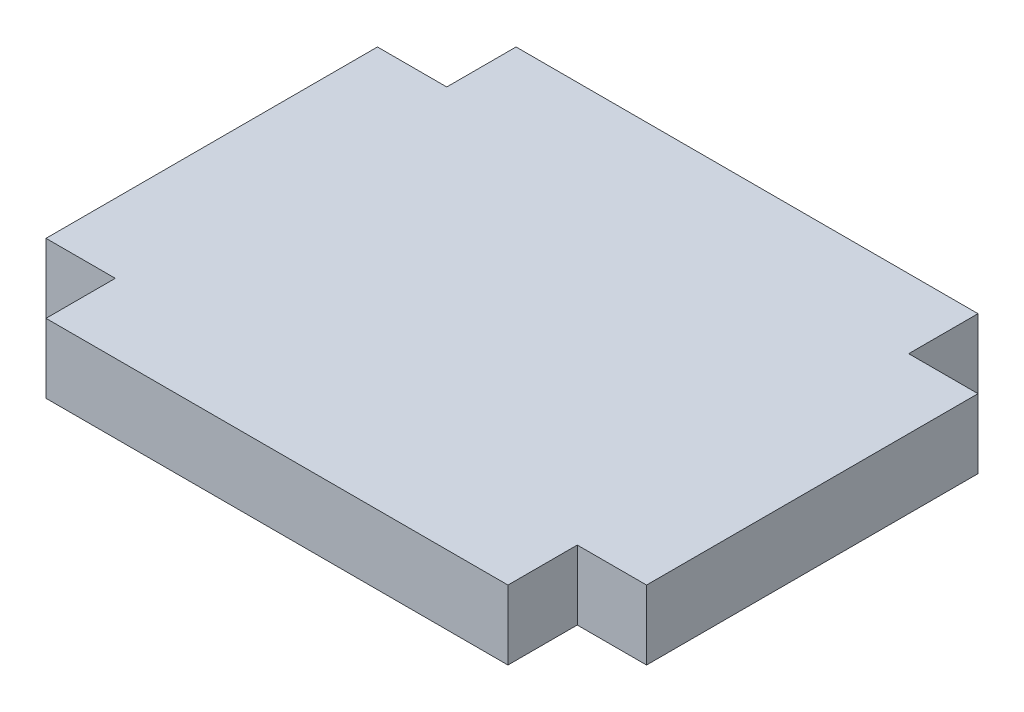
ISO-10303-21;
HEADER;
FILE_DESCRIPTION(('STEP AP214'),'2;1');
FILE_NAME('part.step','',(''),(''),'','','');
FILE_SCHEMA(('AUTOMOTIVE_DESIGN { 1 0 10303 214 1 1 1 1 }'));
ENDSEC;
DATA;
#1=APPLICATION_CONTEXT('core data for automotive mechanical design processes');
#2=APPLICATION_PROTOCOL_DEFINITION('international standard','automotive_design',2000,#1);
#3=PRODUCT_CONTEXT('',#1,'mechanical');
#4=PRODUCT('Part','Part','',(#3));
#5=PRODUCT_RELATED_PRODUCT_CATEGORY('part','',(#4));
#6=PRODUCT_DEFINITION_FORMATION('','',#4);
#7=PRODUCT_DEFINITION_CONTEXT('part definition',#1,'design');
#8=PRODUCT_DEFINITION('design','',#6,#7);
#9=PRODUCT_DEFINITION_SHAPE('','',#8);
#10=(LENGTH_UNIT() NAMED_UNIT(*) SI_UNIT(.MILLI.,.METRE.));
#11=(NAMED_UNIT(*) PLANE_ANGLE_UNIT() SI_UNIT($,.RADIAN.));
#12=(NAMED_UNIT(*) SI_UNIT($,.STERADIAN.) SOLID_ANGLE_UNIT());
#13=UNCERTAINTY_MEASURE_WITH_UNIT(LENGTH_MEASURE(1.E-05),#10,'distance_accuracy_value','');
#14=(GEOMETRIC_REPRESENTATION_CONTEXT(3) GLOBAL_UNCERTAINTY_ASSIGNED_CONTEXT((#13)) GLOBAL_UNIT_ASSIGNED_CONTEXT((#10,
#11,#12)) REPRESENTATION_CONTEXT('',''));
#15=CARTESIAN_POINT('',(0.,0.,0.));
#16=DIRECTION('',(0.,0.,1.));
#17=DIRECTION('',(1.,0.,0.));
#18=AXIS2_PLACEMENT_3D('',#15,#16,#17);
#19=CARTESIAN_POINT('',(-10.,1.5,-7.175));
#20=DIRECTION('',(1.,0.,0.));
#21=DIRECTION('',(0.,0.,-1.));
#22=AXIS2_PLACEMENT_3D('',#19,#20,#21);
#23=PLANE('',#22);
#24=DIRECTION('',(0.,0.,1.));
#25=VECTOR('',#24,1.);
#26=CARTESIAN_POINT('',(-10.,-1.5,-7.175));
#27=LINE('',#26,#25);
#28=CARTESIAN_POINT('',(-10.,-1.5,-10.175));
#29=VERTEX_POINT('',#28);
#30=CARTESIAN_POINT('',(-10.,-1.5,-7.175));
#31=VERTEX_POINT('',#30);
#32=EDGE_CURVE('E159',#29,#31,#27,.T.);
#33=ORIENTED_EDGE('',*,*,#32,.T.);
#34=DIRECTION('',(0.,-1.,0.));
#35=VECTOR('',#34,1.);
#36=CARTESIAN_POINT('',(-10.,1.5,-7.175));
#37=LINE('',#36,#35);
#38=CARTESIAN_POINT('',(-10.,1.5,-7.175));
#39=VERTEX_POINT('',#38);
#40=EDGE_CURVE('E11',#39,#31,#37,.T.);
#41=ORIENTED_EDGE('',*,*,#40,.F.);
#42=DIRECTION('',(0.,0.,1.));
#43=VECTOR('',#42,1.);
#44=CARTESIAN_POINT('',(-10.,1.5,-7.175));
#45=LINE('',#44,#43);
#46=CARTESIAN_POINT('',(-10.,1.5,-10.175));
#47=VERTEX_POINT('',#46);
#48=EDGE_CURVE('E181',#47,#39,#45,.T.);
#49=ORIENTED_EDGE('',*,*,#48,.F.);
#50=DIRECTION('',(0.,-1.,0.));
#51=VECTOR('',#50,1.);
#52=CARTESIAN_POINT('',(-10.,1.5,-10.175));
#53=LINE('',#52,#51);
#54=EDGE_CURVE('E155',#47,#29,#53,.T.);
#55=ORIENTED_EDGE('',*,*,#54,.T.);
#56=EDGE_LOOP('',(#33,#41,#49,#55));
#57=FACE_BOUND('',#56,.T.);
#58=ADVANCED_FACE('F39',(#57),#23,.F.);
#59=CARTESIAN_POINT('',(-13.,1.5,-7.175));
#60=DIRECTION('',(0.,0.,1.));
#61=DIRECTION('',(1.,0.,0.));
#62=AXIS2_PLACEMENT_3D('',#59,#60,#61);
#63=PLANE('',#62);
#64=DIRECTION('',(-1.,0.,0.));
#65=VECTOR('',#64,1.);
#66=CARTESIAN_POINT('',(-13.,-1.5,-7.175));
#67=LINE('',#66,#65);
#68=CARTESIAN_POINT('',(-13.,-1.5,-7.175));
#69=VERTEX_POINT('',#68);
#70=EDGE_CURVE('E162',#31,#69,#67,.T.);
#71=ORIENTED_EDGE('',*,*,#70,.T.);
#72=DIRECTION('',(0.,-1.,0.));
#73=VECTOR('',#72,1.);
#74=CARTESIAN_POINT('',(-13.,1.5,-7.175));
#75=LINE('',#74,#73);
#76=CARTESIAN_POINT('',(-13.,1.5,-7.175));
#77=VERTEX_POINT('',#76);
#78=EDGE_CURVE('E47',#77,#69,#75,.T.);
#79=ORIENTED_EDGE('',*,*,#78,.F.);
#80=DIRECTION('',(-1.,0.,0.));
#81=VECTOR('',#80,1.);
#82=CARTESIAN_POINT('',(-13.,1.5,-7.175));
#83=LINE('',#82,#81);
#84=EDGE_CURVE('E110',#39,#77,#83,.T.);
#85=ORIENTED_EDGE('',*,*,#84,.F.);
#86=ORIENTED_EDGE('',*,*,#40,.T.);
#87=EDGE_LOOP('',(#71,#79,#85,#86));
#88=FACE_BOUND('',#87,.T.);
#89=ADVANCED_FACE('F259',(#88),#63,.F.);
#90=CARTESIAN_POINT('',(-13.,1.5,7.175));
#91=DIRECTION('',(1.,0.,0.));
#92=DIRECTION('',(0.,0.,-1.));
#93=AXIS2_PLACEMENT_3D('',#90,#91,#92);
#94=PLANE('',#93);
#95=DIRECTION('',(0.,0.,1.));
#96=VECTOR('',#95,1.);
#97=CARTESIAN_POINT('',(-13.,-1.5,7.175));
#98=LINE('',#97,#96);
#99=CARTESIAN_POINT('',(-13.,-1.5,7.175));
#100=VERTEX_POINT('',#99);
#101=EDGE_CURVE('E164',#69,#100,#98,.T.);
#102=ORIENTED_EDGE('',*,*,#101,.T.);
#103=DIRECTION('',(0.,-1.,0.));
#104=VECTOR('',#103,1.);
#105=CARTESIAN_POINT('',(-13.,1.5,7.175));
#106=LINE('',#105,#104);
#107=CARTESIAN_POINT('',(-13.,1.5,7.175));
#108=VERTEX_POINT('',#107);
#109=EDGE_CURVE('E200',#108,#100,#106,.T.);
#110=ORIENTED_EDGE('',*,*,#109,.F.);
#111=DIRECTION('',(0.,0.,1.));
#112=VECTOR('',#111,1.);
#113=CARTESIAN_POINT('',(-13.,1.5,7.175));
#114=LINE('',#113,#112);
#115=EDGE_CURVE('E208',#77,#108,#114,.T.);
#116=ORIENTED_EDGE('',*,*,#115,.F.);
#117=ORIENTED_EDGE('',*,*,#78,.T.);
#118=EDGE_LOOP('',(#102,#110,#116,#117));
#119=FACE_BOUND('',#118,.T.);
#120=ADVANCED_FACE('F206',(#119),#94,.F.);
#121=CARTESIAN_POINT('',(-10.,1.5,7.175));
#122=DIRECTION('',(0.,0.,-1.));
#123=DIRECTION('',(-1.,0.,0.));
#124=AXIS2_PLACEMENT_3D('',#121,#122,#123);
#125=PLANE('',#124);
#126=DIRECTION('',(1.,0.,0.));
#127=VECTOR('',#126,1.);
#128=CARTESIAN_POINT('',(-10.,-1.5,7.175));
#129=LINE('',#128,#127);
#130=CARTESIAN_POINT('',(-10.,-1.5,7.175));
#131=VERTEX_POINT('',#130);
#132=EDGE_CURVE('E166',#100,#131,#129,.T.);
#133=ORIENTED_EDGE('',*,*,#132,.T.);
#134=DIRECTION('',(0.,-1.,0.));
#135=VECTOR('',#134,1.);
#136=CARTESIAN_POINT('',(-10.,1.5,7.175));
#137=LINE('',#136,#135);
#138=CARTESIAN_POINT('',(-10.,1.5,7.175));
#139=VERTEX_POINT('',#138);
#140=EDGE_CURVE('E197',#139,#131,#137,.T.);
#141=ORIENTED_EDGE('',*,*,#140,.F.);
#142=DIRECTION('',(1.,0.,0.));
#143=VECTOR('',#142,1.);
#144=CARTESIAN_POINT('',(-10.,1.5,7.175));
#145=LINE('',#144,#143);
#146=EDGE_CURVE('E226',#108,#139,#145,.T.);
#147=ORIENTED_EDGE('',*,*,#146,.F.);
#148=ORIENTED_EDGE('',*,*,#109,.T.);
#149=EDGE_LOOP('',(#133,#141,#147,#148));
#150=FACE_BOUND('',#149,.T.);
#151=ADVANCED_FACE('F217',(#150),#125,.F.);
#152=CARTESIAN_POINT('',(-10.,1.5,10.175));
#153=DIRECTION('',(1.,0.,0.));
#154=DIRECTION('',(0.,0.,-1.));
#155=AXIS2_PLACEMENT_3D('',#152,#153,#154);
#156=PLANE('',#155);
#157=DIRECTION('',(0.,0.,1.));
#158=VECTOR('',#157,1.);
#159=CARTESIAN_POINT('',(-10.,-1.5,10.175));
#160=LINE('',#159,#158);
#161=CARTESIAN_POINT('',(-10.,-1.5,10.175));
#162=VERTEX_POINT('',#161);
#163=EDGE_CURVE('E168',#131,#162,#160,.T.);
#164=ORIENTED_EDGE('',*,*,#163,.T.);
#165=DIRECTION('',(0.,-1.,0.));
#166=VECTOR('',#165,1.);
#167=CARTESIAN_POINT('',(-10.,1.5,10.175));
#168=LINE('',#167,#166);
#169=CARTESIAN_POINT('',(-10.,1.5,10.175));
#170=VERTEX_POINT('',#169);
#171=EDGE_CURVE('E194',#170,#162,#168,.T.);
#172=ORIENTED_EDGE('',*,*,#171,.F.);
#173=DIRECTION('',(0.,0.,1.));
#174=VECTOR('',#173,1.);
#175=CARTESIAN_POINT('',(-10.,1.5,10.175));
#176=LINE('',#175,#174);
#177=EDGE_CURVE('E223',#139,#170,#176,.T.);
#178=ORIENTED_EDGE('',*,*,#177,.F.);
#179=ORIENTED_EDGE('',*,*,#140,.T.);
#180=EDGE_LOOP('',(#164,#172,#178,#179));
#181=FACE_BOUND('',#180,.T.);
#182=ADVANCED_FACE('F221',(#181),#156,.F.);
#183=CARTESIAN_POINT('',(10.,1.5,10.175));
#184=DIRECTION('',(0.,0.,-1.));
#185=DIRECTION('',(-1.,0.,0.));
#186=AXIS2_PLACEMENT_3D('',#183,#184,#185);
#187=PLANE('',#186);
#188=DIRECTION('',(1.,0.,0.));
#189=VECTOR('',#188,1.);
#190=CARTESIAN_POINT('',(10.,-1.5,10.175));
#191=LINE('',#190,#189);
#192=CARTESIAN_POINT('',(10.,-1.5,10.175));
#193=VERTEX_POINT('',#192);
#194=EDGE_CURVE('E170',#162,#193,#191,.T.);
#195=ORIENTED_EDGE('',*,*,#194,.T.);
#196=DIRECTION('',(0.,-1.,0.));
#197=VECTOR('',#196,1.);
#198=CARTESIAN_POINT('',(10.,1.5,10.175));
#199=LINE('',#198,#197);
#200=CARTESIAN_POINT('',(10.,1.5,10.175));
#201=VERTEX_POINT('',#200);
#202=EDGE_CURVE('E191',#201,#193,#199,.T.);
#203=ORIENTED_EDGE('',*,*,#202,.F.);
#204=DIRECTION('',(1.,0.,0.));
#205=VECTOR('',#204,1.);
#206=CARTESIAN_POINT('',(10.,1.5,10.175));
#207=LINE('',#206,#205);
#208=EDGE_CURVE('E225',#170,#201,#207,.T.);
#209=ORIENTED_EDGE('',*,*,#208,.F.);
#210=ORIENTED_EDGE('',*,*,#171,.T.);
#211=EDGE_LOOP('',(#195,#203,#209,#210));
#212=FACE_BOUND('',#211,.T.);
#213=ADVANCED_FACE('F272',(#212),#187,.F.);
#214=CARTESIAN_POINT('',(10.,1.5,7.175));
#215=DIRECTION('',(-1.,0.,0.));
#216=DIRECTION('',(0.,0.,1.));
#217=AXIS2_PLACEMENT_3D('',#214,#215,#216);
#218=PLANE('',#217);
#219=DIRECTION('',(0.,0.,-1.));
#220=VECTOR('',#219,1.);
#221=CARTESIAN_POINT('',(10.,-1.5,7.175));
#222=LINE('',#221,#220);
#223=CARTESIAN_POINT('',(10.,-1.5,7.175));
#224=VERTEX_POINT('',#223);
#225=EDGE_CURVE('E172',#193,#224,#222,.T.);
#226=ORIENTED_EDGE('',*,*,#225,.T.);
#227=DIRECTION('',(0.,-1.,0.));
#228=VECTOR('',#227,1.);
#229=CARTESIAN_POINT('',(10.,1.5,7.175));
#230=LINE('',#229,#228);
#231=CARTESIAN_POINT('',(10.,1.5,7.175));
#232=VERTEX_POINT('',#231);
#233=EDGE_CURVE('E188',#232,#224,#230,.T.);
#234=ORIENTED_EDGE('',*,*,#233,.F.);
#235=DIRECTION('',(0.,0.,-1.));
#236=VECTOR('',#235,1.);
#237=CARTESIAN_POINT('',(10.,1.5,7.175));
#238=LINE('',#237,#236);
#239=EDGE_CURVE('E228',#201,#232,#238,.T.);
#240=ORIENTED_EDGE('',*,*,#239,.F.);
#241=ORIENTED_EDGE('',*,*,#202,.T.);
#242=EDGE_LOOP('',(#226,#234,#240,#241));
#243=FACE_BOUND('',#242,.T.);
#244=ADVANCED_FACE('F275',(#243),#218,.F.);
#245=CARTESIAN_POINT('',(13.,1.5,7.175));
#246=DIRECTION('',(0.,0.,-1.));
#247=DIRECTION('',(-1.,0.,0.));
#248=AXIS2_PLACEMENT_3D('',#245,#246,#247);
#249=PLANE('',#248);
#250=DIRECTION('',(1.,0.,0.));
#251=VECTOR('',#250,1.);
#252=CARTESIAN_POINT('',(13.,-1.5,7.175));
#253=LINE('',#252,#251);
#254=CARTESIAN_POINT('',(13.,-1.5,7.175));
#255=VERTEX_POINT('',#254);
#256=EDGE_CURVE('E174',#224,#255,#253,.T.);
#257=ORIENTED_EDGE('',*,*,#256,.T.);
#258=DIRECTION('',(0.,-1.,0.));
#259=VECTOR('',#258,1.);
#260=CARTESIAN_POINT('',(13.,1.5,7.175));
#261=LINE('',#260,#259);
#262=CARTESIAN_POINT('',(13.,1.5,7.175));
#263=VERTEX_POINT('',#262);
#264=EDGE_CURVE('E185',#263,#255,#261,.T.);
#265=ORIENTED_EDGE('',*,*,#264,.F.);
#266=DIRECTION('',(1.,0.,0.));
#267=VECTOR('',#266,1.);
#268=CARTESIAN_POINT('',(13.,1.5,7.175));
#269=LINE('',#268,#267);
#270=EDGE_CURVE('E234',#232,#263,#269,.T.);
#271=ORIENTED_EDGE('',*,*,#270,.F.);
#272=ORIENTED_EDGE('',*,*,#233,.T.);
#273=EDGE_LOOP('',(#257,#265,#271,#272));
#274=FACE_BOUND('',#273,.T.);
#275=ADVANCED_FACE('F240',(#274),#249,.F.);
#276=CARTESIAN_POINT('',(13.,1.5,-7.175));
#277=DIRECTION('',(-1.,0.,0.));
#278=DIRECTION('',(0.,0.,1.));
#279=AXIS2_PLACEMENT_3D('',#276,#277,#278);
#280=PLANE('',#279);
#281=DIRECTION('',(0.,0.,-1.));
#282=VECTOR('',#281,1.);
#283=CARTESIAN_POINT('',(13.,-1.5,-7.175));
#284=LINE('',#283,#282);
#285=CARTESIAN_POINT('',(13.,-1.5,-7.175));
#286=VERTEX_POINT('',#285);
#287=EDGE_CURVE('E176',#255,#286,#284,.T.);
#288=ORIENTED_EDGE('',*,*,#287,.T.);
#289=DIRECTION('',(0.,-1.,0.));
#290=VECTOR('',#289,1.);
#291=CARTESIAN_POINT('',(13.,1.5,-7.175));
#292=LINE('',#291,#290);
#293=CARTESIAN_POINT('',(13.,1.5,-7.175));
#294=VERTEX_POINT('',#293);
#295=EDGE_CURVE('E150',#294,#286,#292,.T.);
#296=ORIENTED_EDGE('',*,*,#295,.F.);
#297=DIRECTION('',(0.,0.,-1.));
#298=VECTOR('',#297,1.);
#299=CARTESIAN_POINT('',(13.,1.5,-7.175));
#300=LINE('',#299,#298);
#301=EDGE_CURVE('E141',#263,#294,#300,.T.);
#302=ORIENTED_EDGE('',*,*,#301,.F.);
#303=ORIENTED_EDGE('',*,*,#264,.T.);
#304=EDGE_LOOP('',(#288,#296,#302,#303));
#305=FACE_BOUND('',#304,.T.);
#306=ADVANCED_FACE('F244',(#305),#280,.F.);
#307=CARTESIAN_POINT('',(10.,1.5,-7.175));
#308=DIRECTION('',(0.,0.,1.));
#309=DIRECTION('',(1.,0.,0.));
#310=AXIS2_PLACEMENT_3D('',#307,#308,#309);
#311=PLANE('',#310);
#312=DIRECTION('',(-1.,0.,0.));
#313=VECTOR('',#312,1.);
#314=CARTESIAN_POINT('',(10.,-1.5,-7.175));
#315=LINE('',#314,#313);
#316=CARTESIAN_POINT('',(10.,-1.5,-7.175));
#317=VERTEX_POINT('',#316);
#318=EDGE_CURVE('E149',#286,#317,#315,.T.);
#319=ORIENTED_EDGE('',*,*,#318,.T.);
#320=DIRECTION('',(0.,-1.,0.));
#321=VECTOR('',#320,1.);
#322=CARTESIAN_POINT('',(10.,1.5,-7.175));
#323=LINE('',#322,#321);
#324=CARTESIAN_POINT('',(10.,1.5,-7.175));
#325=VERTEX_POINT('',#324);
#326=EDGE_CURVE('E146',#325,#317,#323,.T.);
#327=ORIENTED_EDGE('',*,*,#326,.F.);
#328=DIRECTION('',(-1.,0.,0.));
#329=VECTOR('',#328,1.);
#330=CARTESIAN_POINT('',(10.,1.5,-7.175));
#331=LINE('',#330,#329);
#332=EDGE_CURVE('E135',#294,#325,#331,.T.);
#333=ORIENTED_EDGE('',*,*,#332,.F.);
#334=ORIENTED_EDGE('',*,*,#295,.T.);
#335=EDGE_LOOP('',(#319,#327,#333,#334));
#336=FACE_BOUND('',#335,.T.);
#337=ADVANCED_FACE('F147',(#336),#311,.F.);
#338=CARTESIAN_POINT('',(10.,1.5,-10.175));
#339=DIRECTION('',(-1.,0.,0.));
#340=DIRECTION('',(0.,0.,1.));
#341=AXIS2_PLACEMENT_3D('',#338,#339,#340);
#342=PLANE('',#341);
#343=DIRECTION('',(0.,0.,-1.));
#344=VECTOR('',#343,1.);
#345=CARTESIAN_POINT('',(10.,-1.5,-10.175));
#346=LINE('',#345,#344);
#347=CARTESIAN_POINT('',(10.,-1.5,-10.175));
#348=VERTEX_POINT('',#347);
#349=EDGE_CURVE('E96',#317,#348,#346,.T.);
#350=ORIENTED_EDGE('',*,*,#349,.T.);
#351=DIRECTION('',(0.,-1.,0.));
#352=VECTOR('',#351,1.);
#353=CARTESIAN_POINT('',(10.,1.5,-10.175));
#354=LINE('',#353,#352);
#355=CARTESIAN_POINT('',(10.,1.5,-10.175));
#356=VERTEX_POINT('',#355);
#357=EDGE_CURVE('E151',#356,#348,#354,.T.);
#358=ORIENTED_EDGE('',*,*,#357,.F.);
#359=DIRECTION('',(0.,0.,-1.));
#360=VECTOR('',#359,1.);
#361=CARTESIAN_POINT('',(10.,1.5,-10.175));
#362=LINE('',#361,#360);
#363=EDGE_CURVE('E139',#325,#356,#362,.T.);
#364=ORIENTED_EDGE('',*,*,#363,.F.);
#365=ORIENTED_EDGE('',*,*,#326,.T.);
#366=EDGE_LOOP('',(#350,#358,#364,#365));
#367=FACE_BOUND('',#366,.T.);
#368=ADVANCED_FACE('F153',(#367),#342,.F.);
#369=CARTESIAN_POINT('',(-10.,1.5,-10.175));
#370=DIRECTION('',(0.,0.,1.));
#371=DIRECTION('',(1.,0.,0.));
#372=AXIS2_PLACEMENT_3D('',#369,#370,#371);
#373=PLANE('',#372);
#374=DIRECTION('',(-1.,0.,0.));
#375=VECTOR('',#374,1.);
#376=CARTESIAN_POINT('',(-10.,-1.5,-10.175));
#377=LINE('',#376,#375);
#378=EDGE_CURVE('E102',#348,#29,#377,.T.);
#379=ORIENTED_EDGE('',*,*,#378,.T.);
#380=ORIENTED_EDGE('',*,*,#54,.F.);
#381=DIRECTION('',(-1.,0.,0.));
#382=VECTOR('',#381,1.);
#383=CARTESIAN_POINT('',(-10.,1.5,-10.175));
#384=LINE('',#383,#382);
#385=EDGE_CURVE('E55',#356,#47,#384,.T.);
#386=ORIENTED_EDGE('',*,*,#385,.F.);
#387=ORIENTED_EDGE('',*,*,#357,.T.);
#388=EDGE_LOOP('',(#379,#380,#386,#387));
#389=FACE_BOUND('',#388,.T.);
#390=ADVANCED_FACE('F248',(#389),#373,.F.);
#391=CARTESIAN_POINT('',(0.,1.5,0.));
#392=DIRECTION('',(0.,-1.,0.));
#393=DIRECTION('',(0.,0.,-1.));
#394=AXIS2_PLACEMENT_3D('',#391,#392,#393);
#395=PLANE('',#394);
#396=ORIENTED_EDGE('',*,*,#48,.T.);
#397=ORIENTED_EDGE('',*,*,#84,.T.);
#398=ORIENTED_EDGE('',*,*,#115,.T.);
#399=ORIENTED_EDGE('',*,*,#146,.T.);
#400=ORIENTED_EDGE('',*,*,#177,.T.);
#401=ORIENTED_EDGE('',*,*,#208,.T.);
#402=ORIENTED_EDGE('',*,*,#239,.T.);
#403=ORIENTED_EDGE('',*,*,#270,.T.);
#404=ORIENTED_EDGE('',*,*,#301,.T.);
#405=ORIENTED_EDGE('',*,*,#332,.T.);
#406=ORIENTED_EDGE('',*,*,#363,.T.);
#407=ORIENTED_EDGE('',*,*,#385,.T.);
#408=EDGE_LOOP('',(#396,#397,#398,#399,#400,#401,#402,#403,#404,#405,#406,#407));
#409=FACE_BOUND('',#408,.T.);
#410=ADVANCED_FACE('F137',(#409),#395,.F.);
#411=CARTESIAN_POINT('',(0.,-1.5,0.));
#412=DIRECTION('',(0.,-1.,0.));
#413=DIRECTION('',(0.,0.,-1.));
#414=AXIS2_PLACEMENT_3D('',#411,#412,#413);
#415=PLANE('',#414);
#416=ORIENTED_EDGE('',*,*,#32,.F.);
#417=ORIENTED_EDGE('',*,*,#378,.F.);
#418=ORIENTED_EDGE('',*,*,#349,.F.);
#419=ORIENTED_EDGE('',*,*,#318,.F.);
#420=ORIENTED_EDGE('',*,*,#287,.F.);
#421=ORIENTED_EDGE('',*,*,#256,.F.);
#422=ORIENTED_EDGE('',*,*,#225,.F.);
#423=ORIENTED_EDGE('',*,*,#194,.F.);
#424=ORIENTED_EDGE('',*,*,#163,.F.);
#425=ORIENTED_EDGE('',*,*,#132,.F.);
#426=ORIENTED_EDGE('',*,*,#101,.F.);
#427=ORIENTED_EDGE('',*,*,#70,.F.);
#428=EDGE_LOOP('',(#416,#417,#418,#419,#420,#421,#422,#423,#424,#425,#426,#427));
#429=FACE_BOUND('',#428,.T.);
#430=ADVANCED_FACE('F212',(#429),#415,.T.);
#431=CLOSED_SHELL('',(#58,#89,#120,#151,#182,#213,#244,#275,#306,#337,#368,#390,#410,#430));
#432=MANIFOLD_SOLID_BREP('B2',#431);
#433=ADVANCED_BREP_SHAPE_REPRESENTATION('',(#18,#432),#14);
#434=SHAPE_DEFINITION_REPRESENTATION(#9,#433);
ENDSEC;
END-ISO-10303-21;
